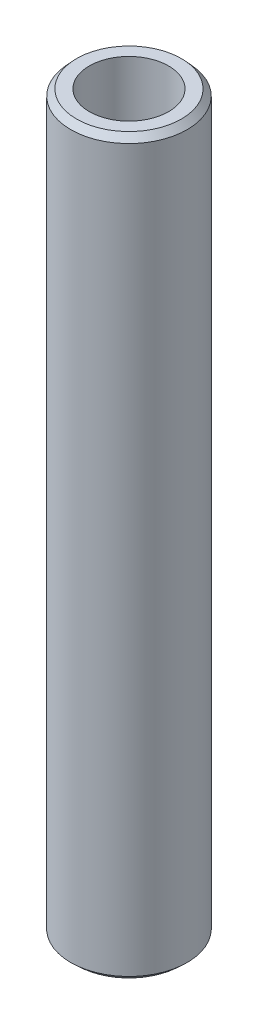
ISO-10303-21;
HEADER;
FILE_DESCRIPTION(('STEP AP214'),'2;1');
FILE_NAME('part.step','',(''),(''),'','','');
FILE_SCHEMA(('AUTOMOTIVE_DESIGN { 1 0 10303 214 1 1 1 1 }'));
ENDSEC;
DATA;
#1=APPLICATION_CONTEXT('core data for automotive mechanical design processes');
#2=APPLICATION_PROTOCOL_DEFINITION('international standard','automotive_design',2000,#1);
#3=PRODUCT_CONTEXT('',#1,'mechanical');
#4=PRODUCT('Part','Part','',(#3));
#5=PRODUCT_RELATED_PRODUCT_CATEGORY('part','',(#4));
#6=PRODUCT_DEFINITION_FORMATION('','',#4);
#7=PRODUCT_DEFINITION_CONTEXT('part definition',#1,'design');
#8=PRODUCT_DEFINITION('design','',#6,#7);
#9=PRODUCT_DEFINITION_SHAPE('','',#8);
#10=(LENGTH_UNIT() NAMED_UNIT(*) SI_UNIT(.MILLI.,.METRE.));
#11=(NAMED_UNIT(*) PLANE_ANGLE_UNIT() SI_UNIT($,.RADIAN.));
#12=(NAMED_UNIT(*) SI_UNIT($,.STERADIAN.) SOLID_ANGLE_UNIT());
#13=UNCERTAINTY_MEASURE_WITH_UNIT(LENGTH_MEASURE(1.E-05),#10,'distance_accuracy_value','');
#14=(GEOMETRIC_REPRESENTATION_CONTEXT(3) GLOBAL_UNCERTAINTY_ASSIGNED_CONTEXT((#13)) GLOBAL_UNIT_ASSIGNED_CONTEXT((#10,
#11,#12)) REPRESENTATION_CONTEXT('',''));
#15=CARTESIAN_POINT('',(0.,0.,0.));
#16=DIRECTION('',(0.,0.,1.));
#17=DIRECTION('',(1.,0.,0.));
#18=AXIS2_PLACEMENT_3D('',#15,#16,#17);
#19=CARTESIAN_POINT('',(0.,220.509976347771,0.));
#20=DIRECTION('',(0.,-1.,0.));
#21=DIRECTION('',(0.,0.,-1.));
#22=AXIS2_PLACEMENT_3D('',#19,#20,#21);
#23=CYLINDRICAL_SURFACE('',#22,17.5);
#24=CARTESIAN_POINT('',(0.,218.614966521309,0.));
#25=DIRECTION('',(0.,1.,0.));
#26=DIRECTION('',(0.,0.,1.));
#27=AXIS2_PLACEMENT_3D('',#24,#25,#26);
#28=CIRCLE('',#27,17.5);
#29=CARTESIAN_POINT('',(0.,218.614966521309,17.5));
#30=VERTEX_POINT('',#29);
#31=EDGE_CURVE('E50',#30,#30,#28,.F.);
#32=ORIENTED_EDGE('',*,*,#31,.T.);
#33=EDGE_LOOP('',(#32));
#34=FACE_BOUND('',#33,.T.);
#35=CARTESIAN_POINT('',(0.,1.74176360538003,0.));
#36=DIRECTION('',(0.,1.,0.));
#37=DIRECTION('',(0.,0.,1.));
#38=AXIS2_PLACEMENT_3D('',#35,#36,#37);
#39=CIRCLE('',#38,17.5);
#40=CARTESIAN_POINT('',(0.,1.74176360538003,17.5));
#41=VERTEX_POINT('',#40);
#42=EDGE_CURVE('E51',#41,#41,#39,.T.);
#43=ORIENTED_EDGE('',*,*,#42,.T.);
#44=EDGE_LOOP('',(#43));
#45=FACE_BOUND('',#44,.T.);
#46=ADVANCED_FACE('F39',(#34,#45),#23,.T.);
#47=CARTESIAN_POINT('',(0.,220.509976347771,0.));
#48=DIRECTION('',(0.,1.,0.));
#49=DIRECTION('',(0.,0.,1.));
#50=AXIS2_PLACEMENT_3D('',#47,#48,#49);
#51=PLANE('',#50);
#52=CARTESIAN_POINT('',(0.,220.509976347771,0.));
#53=DIRECTION('',(0.,1.,0.));
#54=DIRECTION('',(0.,0.,1.));
#55=AXIS2_PLACEMENT_3D('',#52,#53,#54);
#56=CIRCLE('',#55,15.7582363946199);
#57=CARTESIAN_POINT('',(0.,220.509976347771,15.7582363946199));
#58=VERTEX_POINT('',#57);
#59=EDGE_CURVE('E54',#58,#58,#56,.T.);
#60=ORIENTED_EDGE('',*,*,#59,.T.);
#61=EDGE_LOOP('',(#60));
#62=FACE_BOUND('',#61,.T.);
#63=CARTESIAN_POINT('',(0.,220.509976347771,0.));
#64=DIRECTION('',(0.,1.,0.));
#65=DIRECTION('',(0.,0.,1.));
#66=AXIS2_PLACEMENT_3D('',#63,#64,#65);
#67=CIRCLE('',#66,11.9228200627864);
#68=CARTESIAN_POINT('',(0.,220.509976347771,11.9228200627864));
#69=VERTEX_POINT('',#68);
#70=EDGE_CURVE('E58',#69,#69,#67,.T.);
#71=ORIENTED_EDGE('',*,*,#70,.F.);
#72=EDGE_LOOP('',(#71));
#73=FACE_BOUND('',#72,.T.);
#74=ADVANCED_FACE('F69',(#62,#73),#51,.T.);
#75=CARTESIAN_POINT('',(0.,0.,0.));
#76=DIRECTION('',(0.,1.,0.));
#77=DIRECTION('',(0.,0.,1.));
#78=AXIS2_PLACEMENT_3D('',#75,#76,#77);
#79=PLANE('',#78);
#80=CARTESIAN_POINT('',(0.,0.,0.));
#81=DIRECTION('',(0.,1.,0.));
#82=DIRECTION('',(0.,0.,1.));
#83=AXIS2_PLACEMENT_3D('',#80,#81,#82);
#84=CIRCLE('',#83,15.604990173538);
#85=CARTESIAN_POINT('',(0.,0.,15.604990173538));
#86=VERTEX_POINT('',#85);
#87=EDGE_CURVE('E10',#86,#86,#84,.F.);
#88=ORIENTED_EDGE('',*,*,#87,.T.);
#89=EDGE_LOOP('',(#88));
#90=FACE_BOUND('',#89,.T.);
#91=CARTESIAN_POINT('',(0.,0.,0.));
#92=DIRECTION('',(0.,1.,0.));
#93=DIRECTION('',(0.,0.,1.));
#94=AXIS2_PLACEMENT_3D('',#91,#92,#93);
#95=CIRCLE('',#94,11.9228200627864);
#96=CARTESIAN_POINT('',(0.,0.,11.9228200627864));
#97=VERTEX_POINT('',#96);
#98=EDGE_CURVE('E63',#97,#97,#95,.T.);
#99=ORIENTED_EDGE('',*,*,#98,.T.);
#100=EDGE_LOOP('',(#99));
#101=FACE_BOUND('',#100,.T.);
#102=ADVANCED_FACE('F75',(#90,#101),#79,.F.);
#103=CARTESIAN_POINT('',(0.,220.509976347771,0.));
#104=DIRECTION('',(0.,-1.,0.));
#105=DIRECTION('',(0.,0.,-1.));
#106=AXIS2_PLACEMENT_3D('',#103,#104,#105);
#107=CYLINDRICAL_SURFACE('',#106,11.9228200627864);
#108=ORIENTED_EDGE('',*,*,#70,.T.);
#109=EDGE_LOOP('',(#108));
#110=FACE_BOUND('',#109,.T.);
#111=ORIENTED_EDGE('',*,*,#98,.F.);
#112=EDGE_LOOP('',(#111));
#113=FACE_BOUND('',#112,.T.);
#114=ADVANCED_FACE('F70',(#110,#113),#107,.F.);
#115=CARTESIAN_POINT('',(0.,220.509976347771,0.));
#116=DIRECTION('',(0.,-1.,0.));
#117=DIRECTION('',(0.,0.,-1.));
#118=AXIS2_PLACEMENT_3D('',#115,#116,#117);
#119=CONICAL_SURFACE('',#118,15.7582363946199,0.743285114913877);
#120=ORIENTED_EDGE('',*,*,#31,.F.);
#121=EDGE_LOOP('',(#120));
#122=FACE_BOUND('',#121,.T.);
#123=ORIENTED_EDGE('',*,*,#59,.F.);
#124=EDGE_LOOP('',(#123));
#125=FACE_BOUND('',#124,.T.);
#126=ADVANCED_FACE('F81',(#122,#125),#119,.T.);
#127=CARTESIAN_POINT('',(0.,1.74176360538003,0.));
#128=DIRECTION('',(0.,1.,0.));
#129=DIRECTION('',(0.,0.,1.));
#130=AXIS2_PLACEMENT_3D('',#127,#128,#129);
#131=CONICAL_SURFACE('',#130,17.5,0.827511211881023);
#132=ORIENTED_EDGE('',*,*,#87,.F.);
#133=EDGE_LOOP('',(#132));
#134=FACE_BOUND('',#133,.T.);
#135=ORIENTED_EDGE('',*,*,#42,.F.);
#136=EDGE_LOOP('',(#135));
#137=FACE_BOUND('',#136,.T.);
#138=ADVANCED_FACE('F45',(#134,#137),#131,.T.);
#139=CLOSED_SHELL('',(#46,#74,#102,#114,#126,#138));
#140=MANIFOLD_SOLID_BREP('B2',#139);
#141=ADVANCED_BREP_SHAPE_REPRESENTATION('',(#18,#140),#14);
#142=SHAPE_DEFINITION_REPRESENTATION(#9,#141);
ENDSEC;
END-ISO-10303-21;
